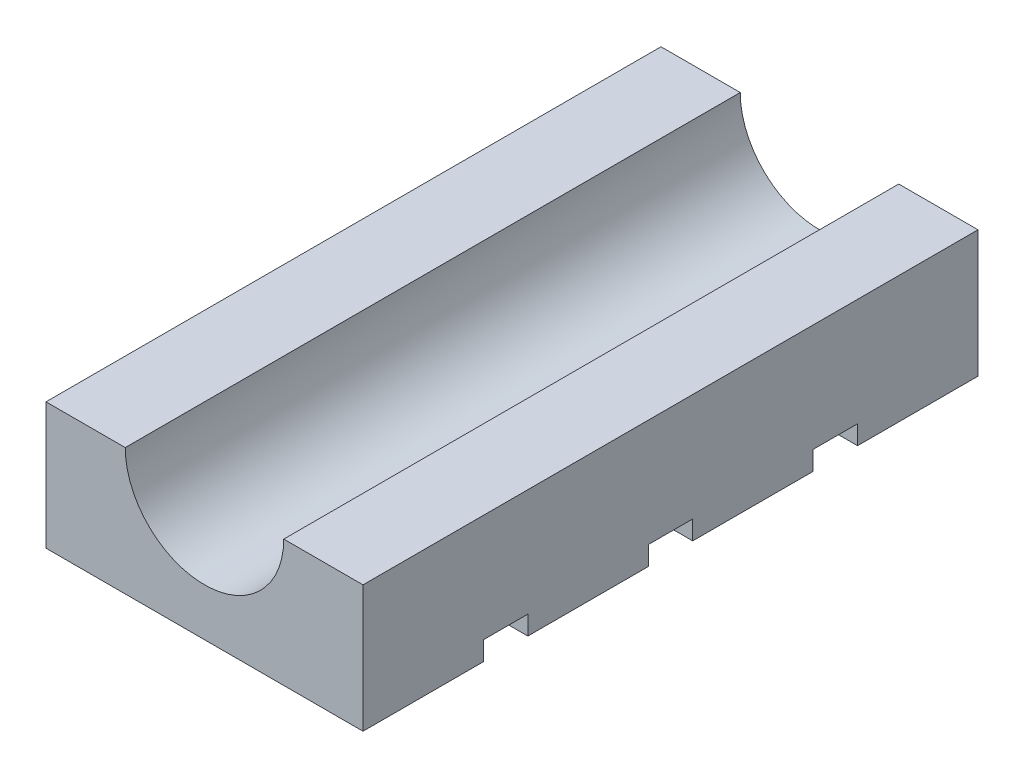
ISO-10303-21;
HEADER;
FILE_DESCRIPTION(('STEP AP214'),'2;1');
FILE_NAME('part.step','',(''),(''),'','','');
FILE_SCHEMA(('AUTOMOTIVE_DESIGN { 1 0 10303 214 1 1 1 1 }'));
ENDSEC;
DATA;
#1=APPLICATION_CONTEXT('core data for automotive mechanical design processes');
#2=APPLICATION_PROTOCOL_DEFINITION('international standard','automotive_design',2000,#1);
#3=PRODUCT_CONTEXT('',#1,'mechanical');
#4=PRODUCT('Part','Part','',(#3));
#5=PRODUCT_RELATED_PRODUCT_CATEGORY('part','',(#4));
#6=PRODUCT_DEFINITION_FORMATION('','',#4);
#7=PRODUCT_DEFINITION_CONTEXT('part definition',#1,'design');
#8=PRODUCT_DEFINITION('design','',#6,#7);
#9=PRODUCT_DEFINITION_SHAPE('','',#8);
#10=(LENGTH_UNIT() NAMED_UNIT(*) SI_UNIT(.MILLI.,.METRE.));
#11=(NAMED_UNIT(*) PLANE_ANGLE_UNIT() SI_UNIT($,.RADIAN.));
#12=(NAMED_UNIT(*) SI_UNIT($,.STERADIAN.) SOLID_ANGLE_UNIT());
#13=UNCERTAINTY_MEASURE_WITH_UNIT(LENGTH_MEASURE(1.E-05),#10,'distance_accuracy_value','');
#14=(GEOMETRIC_REPRESENTATION_CONTEXT(3) GLOBAL_UNCERTAINTY_ASSIGNED_CONTEXT((#13)) GLOBAL_UNIT_ASSIGNED_CONTEXT((#10,
#11,#12)) REPRESENTATION_CONTEXT('',''));
#15=CARTESIAN_POINT('',(0.,0.,0.));
#16=DIRECTION('',(0.,0.,1.));
#17=DIRECTION('',(1.,0.,0.));
#18=AXIS2_PLACEMENT_3D('',#15,#16,#17);
#19=CARTESIAN_POINT('',(0.,0.,0.));
#20=DIRECTION('',(0.,1.,0.));
#21=DIRECTION('',(0.,0.,1.));
#22=AXIS2_PLACEMENT_3D('',#19,#20,#21);
#23=PLANE('',#22);
#24=DIRECTION('',(0.,0.,1.));
#25=VECTOR('',#24,1.);
#26=CARTESIAN_POINT('',(0.,0.,0.));
#27=LINE('',#26,#25);
#28=CARTESIAN_POINT('',(0.,0.,78.));
#29=VERTEX_POINT('',#28);
#30=CARTESIAN_POINT('',(0.,0.,97.));
#31=VERTEX_POINT('',#30);
#32=EDGE_CURVE('E239',#29,#31,#27,.T.);
#33=ORIENTED_EDGE('',*,*,#32,.F.);
#34=DIRECTION('',(-1.,0.,0.));
#35=VECTOR('',#34,1.);
#36=CARTESIAN_POINT('',(0.,0.,78.));
#37=LINE('',#36,#35);
#38=CARTESIAN_POINT('',(50.,0.,78.));
#39=VERTEX_POINT('',#38);
#40=EDGE_CURVE('E172',#39,#29,#37,.T.);
#41=ORIENTED_EDGE('',*,*,#40,.F.);
#42=DIRECTION('',(0.,0.,-1.));
#43=VECTOR('',#42,1.);
#44=CARTESIAN_POINT('',(50.,0.,0.));
#45=LINE('',#44,#43);
#46=CARTESIAN_POINT('',(50.,0.,97.));
#47=VERTEX_POINT('',#46);
#48=EDGE_CURVE('E262',#47,#39,#45,.T.);
#49=ORIENTED_EDGE('',*,*,#48,.F.);
#50=DIRECTION('',(1.,0.,0.));
#51=VECTOR('',#50,1.);
#52=CARTESIAN_POINT('',(0.,0.,97.));
#53=LINE('',#52,#51);
#54=EDGE_CURVE('E258',#31,#47,#53,.T.);
#55=ORIENTED_EDGE('',*,*,#54,.F.);
#56=EDGE_LOOP('',(#33,#41,#49,#55));
#57=FACE_BOUND('',#56,.T.);
#58=ADVANCED_FACE('F33',(#57),#23,.F.);
#59=CARTESIAN_POINT('',(50.,0.,71.));
#60=VERTEX_POINT('',#59);
#61=CARTESIAN_POINT('',(50.,0.,52.));
#62=VERTEX_POINT('',#61);
#63=EDGE_CURVE('E265',#60,#62,#45,.T.);
#64=ORIENTED_EDGE('',*,*,#63,.F.);
#65=DIRECTION('',(1.,0.,0.));
#66=VECTOR('',#65,1.);
#67=CARTESIAN_POINT('',(0.,0.,71.));
#68=LINE('',#67,#66);
#69=CARTESIAN_POINT('',(0.,0.,71.));
#70=VERTEX_POINT('',#69);
#71=EDGE_CURVE('E202',#70,#60,#68,.T.);
#72=ORIENTED_EDGE('',*,*,#71,.F.);
#73=CARTESIAN_POINT('',(0.,0.,52.));
#74=VERTEX_POINT('',#73);
#75=EDGE_CURVE('E177',#74,#70,#27,.T.);
#76=ORIENTED_EDGE('',*,*,#75,.F.);
#77=DIRECTION('',(-1.,0.,0.));
#78=VECTOR('',#77,1.);
#79=CARTESIAN_POINT('',(0.,0.,52.));
#80=LINE('',#79,#78);
#81=EDGE_CURVE('E188',#62,#74,#80,.T.);
#82=ORIENTED_EDGE('',*,*,#81,.F.);
#83=EDGE_LOOP('',(#64,#72,#76,#82));
#84=FACE_BOUND('',#83,.T.);
#85=ADVANCED_FACE('F326',(#84),#23,.F.);
#86=CARTESIAN_POINT('',(50.,0.,45.));
#87=VERTEX_POINT('',#86);
#88=CARTESIAN_POINT('',(50.,0.,26.));
#89=VERTEX_POINT('',#88);
#90=EDGE_CURVE('E327',#87,#89,#45,.T.);
#91=ORIENTED_EDGE('',*,*,#90,.F.);
#92=DIRECTION('',(1.,0.,0.));
#93=VECTOR('',#92,1.);
#94=CARTESIAN_POINT('',(0.,0.,45.));
#95=LINE('',#94,#93);
#96=CARTESIAN_POINT('',(0.,0.,45.));
#97=VERTEX_POINT('',#96);
#98=EDGE_CURVE('E196',#97,#87,#95,.T.);
#99=ORIENTED_EDGE('',*,*,#98,.F.);
#100=CARTESIAN_POINT('',(0.,0.,26.));
#101=VERTEX_POINT('',#100);
#102=EDGE_CURVE('E259',#101,#97,#27,.T.);
#103=ORIENTED_EDGE('',*,*,#102,.F.);
#104=DIRECTION('',(-1.,0.,0.));
#105=VECTOR('',#104,1.);
#106=CARTESIAN_POINT('',(0.,0.,26.));
#107=LINE('',#106,#105);
#108=EDGE_CURVE('E213',#89,#101,#107,.T.);
#109=ORIENTED_EDGE('',*,*,#108,.F.);
#110=EDGE_LOOP('',(#91,#99,#103,#109));
#111=FACE_BOUND('',#110,.T.);
#112=ADVANCED_FACE('F335',(#111),#23,.F.);
#113=CARTESIAN_POINT('',(0.,20.,0.));
#114=DIRECTION('',(0.,1.,0.));
#115=DIRECTION('',(0.,0.,1.));
#116=AXIS2_PLACEMENT_3D('',#113,#114,#115);
#117=PLANE('',#116);
#118=DIRECTION('',(0.,0.,1.));
#119=VECTOR('',#118,1.);
#120=CARTESIAN_POINT('',(12.5,20.,-3.));
#121=LINE('',#120,#119);
#122=CARTESIAN_POINT('',(12.5,20.,0.));
#123=VERTEX_POINT('',#122);
#124=CARTESIAN_POINT('',(12.5,20.,97.));
#125=VERTEX_POINT('',#124);
#126=EDGE_CURVE('E11',#123,#125,#121,.T.);
#127=ORIENTED_EDGE('',*,*,#126,.F.);
#128=DIRECTION('',(-1.,0.,0.));
#129=VECTOR('',#128,1.);
#130=CARTESIAN_POINT('',(0.,20.,0.));
#131=LINE('',#130,#129);
#132=CARTESIAN_POINT('',(0.,20.,0.));
#133=VERTEX_POINT('',#132);
#134=EDGE_CURVE('E250',#123,#133,#131,.T.);
#135=ORIENTED_EDGE('',*,*,#134,.T.);
#136=DIRECTION('',(0.,0.,1.));
#137=VECTOR('',#136,1.);
#138=CARTESIAN_POINT('',(0.,20.,0.));
#139=LINE('',#138,#137);
#140=CARTESIAN_POINT('',(0.,20.,97.));
#141=VERTEX_POINT('',#140);
#142=EDGE_CURVE('E240',#133,#141,#139,.T.);
#143=ORIENTED_EDGE('',*,*,#142,.T.);
#144=DIRECTION('',(1.,0.,0.));
#145=VECTOR('',#144,1.);
#146=CARTESIAN_POINT('',(0.,20.,97.));
#147=LINE('',#146,#145);
#148=EDGE_CURVE('E245',#141,#125,#147,.T.);
#149=ORIENTED_EDGE('',*,*,#148,.T.);
#150=EDGE_LOOP('',(#127,#135,#143,#149));
#151=FACE_BOUND('',#150,.T.);
#152=ADVANCED_FACE('F306',(#151),#117,.T.);
#153=CARTESIAN_POINT('',(0.,20.,0.));
#154=DIRECTION('',(1.,0.,0.));
#155=DIRECTION('',(0.,0.,-1.));
#156=AXIS2_PLACEMENT_3D('',#153,#154,#155);
#157=PLANE('',#156);
#158=DIRECTION('',(0.,0.,-1.));
#159=VECTOR('',#158,1.);
#160=CARTESIAN_POINT('',(0.,3.,78.));
#161=LINE('',#160,#159);
#162=CARTESIAN_POINT('',(0.,3.,78.));
#163=VERTEX_POINT('',#162);
#164=CARTESIAN_POINT('',(0.,3.,71.));
#165=VERTEX_POINT('',#164);
#166=EDGE_CURVE('E163',#163,#165,#161,.T.);
#167=ORIENTED_EDGE('',*,*,#166,.F.);
#168=DIRECTION('',(0.,-1.,0.));
#169=VECTOR('',#168,1.);
#170=CARTESIAN_POINT('',(0.,3.,78.));
#171=LINE('',#170,#169);
#172=EDGE_CURVE('E236',#163,#29,#171,.T.);
#173=ORIENTED_EDGE('',*,*,#172,.T.);
#174=ORIENTED_EDGE('',*,*,#32,.T.);
#175=DIRECTION('',(0.,-1.,0.));
#176=VECTOR('',#175,1.);
#177=CARTESIAN_POINT('',(0.,20.,97.));
#178=LINE('',#177,#176);
#179=EDGE_CURVE('E275',#141,#31,#178,.T.);
#180=ORIENTED_EDGE('',*,*,#179,.F.);
#181=ORIENTED_EDGE('',*,*,#142,.F.);
#182=DIRECTION('',(0.,-1.,0.));
#183=VECTOR('',#182,1.);
#184=CARTESIAN_POINT('',(0.,20.,0.));
#185=LINE('',#184,#183);
#186=CARTESIAN_POINT('',(0.,0.,0.));
#187=VERTEX_POINT('',#186);
#188=EDGE_CURVE('E254',#133,#187,#185,.T.);
#189=ORIENTED_EDGE('',*,*,#188,.T.);
#190=CARTESIAN_POINT('',(0.,0.,19.));
#191=VERTEX_POINT('',#190);
#192=EDGE_CURVE('E255',#187,#191,#27,.T.);
#193=ORIENTED_EDGE('',*,*,#192,.T.);
#194=DIRECTION('',(0.,-1.,0.));
#195=VECTOR('',#194,1.);
#196=CARTESIAN_POINT('',(0.,3.,19.));
#197=LINE('',#196,#195);
#198=CARTESIAN_POINT('',(0.,3.,19.));
#199=VERTEX_POINT('',#198);
#200=EDGE_CURVE('E221',#199,#191,#197,.T.);
#201=ORIENTED_EDGE('',*,*,#200,.F.);
#202=DIRECTION('',(0.,0.,-1.));
#203=VECTOR('',#202,1.);
#204=CARTESIAN_POINT('',(0.,3.,26.));
#205=LINE('',#204,#203);
#206=CARTESIAN_POINT('',(0.,3.,26.));
#207=VERTEX_POINT('',#206);
#208=EDGE_CURVE('E209',#207,#199,#205,.T.);
#209=ORIENTED_EDGE('',*,*,#208,.F.);
#210=DIRECTION('',(0.,-1.,0.));
#211=VECTOR('',#210,1.);
#212=CARTESIAN_POINT('',(0.,3.,26.));
#213=LINE('',#212,#211);
#214=EDGE_CURVE('E198',#207,#101,#213,.T.);
#215=ORIENTED_EDGE('',*,*,#214,.T.);
#216=ORIENTED_EDGE('',*,*,#102,.T.);
#217=DIRECTION('',(0.,-1.,0.));
#218=VECTOR('',#217,1.);
#219=CARTESIAN_POINT('',(0.,3.,45.));
#220=LINE('',#219,#218);
#221=CARTESIAN_POINT('',(0.,3.,45.));
#222=VERTEX_POINT('',#221);
#223=EDGE_CURVE('E56',#222,#97,#220,.T.);
#224=ORIENTED_EDGE('',*,*,#223,.F.);
#225=DIRECTION('',(0.,0.,-1.));
#226=VECTOR('',#225,1.);
#227=CARTESIAN_POINT('',(0.,3.,52.));
#228=LINE('',#227,#226);
#229=CARTESIAN_POINT('',(0.,3.,52.));
#230=VERTEX_POINT('',#229);
#231=EDGE_CURVE('E184',#230,#222,#228,.T.);
#232=ORIENTED_EDGE('',*,*,#231,.F.);
#233=DIRECTION('',(0.,-1.,0.));
#234=VECTOR('',#233,1.);
#235=CARTESIAN_POINT('',(0.,3.,52.));
#236=LINE('',#235,#234);
#237=EDGE_CURVE('E200',#230,#74,#236,.T.);
#238=ORIENTED_EDGE('',*,*,#237,.T.);
#239=ORIENTED_EDGE('',*,*,#75,.T.);
#240=DIRECTION('',(0.,-1.,0.));
#241=VECTOR('',#240,1.);
#242=CARTESIAN_POINT('',(0.,3.,71.));
#243=LINE('',#242,#241);
#244=EDGE_CURVE('E48',#165,#70,#243,.T.);
#245=ORIENTED_EDGE('',*,*,#244,.F.);
#246=EDGE_LOOP('',(#167,#173,#174,#180,#181,#189,#193,#201,#209,#215,#216,#224,#232,#238,#239,#245));
#247=FACE_BOUND('',#246,.T.);
#248=ADVANCED_FACE('F35',(#247),#157,.F.);
#249=CARTESIAN_POINT('',(0.,20.,97.));
#250=DIRECTION('',(0.,0.,-1.));
#251=DIRECTION('',(-1.,0.,0.));
#252=AXIS2_PLACEMENT_3D('',#249,#250,#251);
#253=PLANE('',#252);
#254=CARTESIAN_POINT('',(37.5,20.,97.));
#255=VERTEX_POINT('',#254);
#256=CARTESIAN_POINT('',(50.,20.,97.));
#257=VERTEX_POINT('',#256);
#258=EDGE_CURVE('E243',#255,#257,#147,.T.);
#259=ORIENTED_EDGE('',*,*,#258,.F.);
#260=CARTESIAN_POINT('',(25.,20.,97.));
#261=DIRECTION('',(0.,0.,1.));
#262=DIRECTION('',(1.,0.,0.));
#263=AXIS2_PLACEMENT_3D('',#260,#261,#262);
#264=CIRCLE('',#263,12.5);
#265=EDGE_CURVE('E233',#125,#255,#264,.T.);
#266=ORIENTED_EDGE('',*,*,#265,.F.);
#267=ORIENTED_EDGE('',*,*,#148,.F.);
#268=ORIENTED_EDGE('',*,*,#179,.T.);
#269=ORIENTED_EDGE('',*,*,#54,.T.);
#270=DIRECTION('',(0.,-1.,0.));
#271=VECTOR('',#270,1.);
#272=CARTESIAN_POINT('',(50.,20.,97.));
#273=LINE('',#272,#271);
#274=EDGE_CURVE('E272',#257,#47,#273,.T.);
#275=ORIENTED_EDGE('',*,*,#274,.F.);
#276=EDGE_LOOP('',(#259,#266,#267,#268,#269,#275));
#277=FACE_BOUND('',#276,.T.);
#278=ADVANCED_FACE('F308',(#277),#253,.F.);
#279=CARTESIAN_POINT('',(50.,20.,0.));
#280=DIRECTION('',(-1.,0.,0.));
#281=DIRECTION('',(0.,0.,1.));
#282=AXIS2_PLACEMENT_3D('',#279,#280,#281);
#283=PLANE('',#282);
#284=ORIENTED_EDGE('',*,*,#48,.T.);
#285=DIRECTION('',(0.,-1.,0.));
#286=VECTOR('',#285,1.);
#287=CARTESIAN_POINT('',(50.,3.,78.));
#288=LINE('',#287,#286);
#289=CARTESIAN_POINT('',(50.,3.,78.));
#290=VERTEX_POINT('',#289);
#291=EDGE_CURVE('E179',#290,#39,#288,.T.);
#292=ORIENTED_EDGE('',*,*,#291,.F.);
#293=DIRECTION('',(0.,0.,1.));
#294=VECTOR('',#293,1.);
#295=CARTESIAN_POINT('',(50.,3.,78.));
#296=LINE('',#295,#294);
#297=CARTESIAN_POINT('',(50.,3.,71.));
#298=VERTEX_POINT('',#297);
#299=EDGE_CURVE('E162',#298,#290,#296,.T.);
#300=ORIENTED_EDGE('',*,*,#299,.F.);
#301=DIRECTION('',(0.,-1.,0.));
#302=VECTOR('',#301,1.);
#303=CARTESIAN_POINT('',(50.,3.,71.));
#304=LINE('',#303,#302);
#305=EDGE_CURVE('E159',#298,#60,#304,.T.);
#306=ORIENTED_EDGE('',*,*,#305,.T.);
#307=ORIENTED_EDGE('',*,*,#63,.T.);
#308=DIRECTION('',(0.,-1.,0.));
#309=VECTOR('',#308,1.);
#310=CARTESIAN_POINT('',(50.,3.,52.));
#311=LINE('',#310,#309);
#312=CARTESIAN_POINT('',(50.,3.,52.));
#313=VERTEX_POINT('',#312);
#314=EDGE_CURVE('E203',#313,#62,#311,.T.);
#315=ORIENTED_EDGE('',*,*,#314,.F.);
#316=DIRECTION('',(0.,0.,1.));
#317=VECTOR('',#316,1.);
#318=CARTESIAN_POINT('',(50.,3.,52.));
#319=LINE('',#318,#317);
#320=CARTESIAN_POINT('',(50.,3.,45.));
#321=VERTEX_POINT('',#320);
#322=EDGE_CURVE('E191',#321,#313,#319,.T.);
#323=ORIENTED_EDGE('',*,*,#322,.F.);
#324=DIRECTION('',(0.,-1.,0.));
#325=VECTOR('',#324,1.);
#326=CARTESIAN_POINT('',(50.,3.,45.));
#327=LINE('',#326,#325);
#328=EDGE_CURVE('E205',#321,#87,#327,.T.);
#329=ORIENTED_EDGE('',*,*,#328,.T.);
#330=ORIENTED_EDGE('',*,*,#90,.T.);
#331=DIRECTION('',(0.,-1.,0.));
#332=VECTOR('',#331,1.);
#333=CARTESIAN_POINT('',(50.,3.,26.));
#334=LINE('',#333,#332);
#335=CARTESIAN_POINT('',(50.,3.,26.));
#336=VERTEX_POINT('',#335);
#337=EDGE_CURVE('E227',#336,#89,#334,.T.);
#338=ORIENTED_EDGE('',*,*,#337,.F.);
#339=DIRECTION('',(0.,0.,1.));
#340=VECTOR('',#339,1.);
#341=CARTESIAN_POINT('',(50.,3.,26.));
#342=LINE('',#341,#340);
#343=CARTESIAN_POINT('',(50.,3.,19.));
#344=VERTEX_POINT('',#343);
#345=EDGE_CURVE('E216',#344,#336,#342,.T.);
#346=ORIENTED_EDGE('',*,*,#345,.F.);
#347=DIRECTION('',(0.,-1.,0.));
#348=VECTOR('',#347,1.);
#349=CARTESIAN_POINT('',(50.,3.,19.));
#350=LINE('',#349,#348);
#351=CARTESIAN_POINT('',(50.,0.,19.));
#352=VERTEX_POINT('',#351);
#353=EDGE_CURVE('E229',#344,#352,#350,.T.);
#354=ORIENTED_EDGE('',*,*,#353,.T.);
#355=CARTESIAN_POINT('',(50.,0.,0.));
#356=VERTEX_POINT('',#355);
#357=EDGE_CURVE('E261',#352,#356,#45,.T.);
#358=ORIENTED_EDGE('',*,*,#357,.T.);
#359=DIRECTION('',(0.,-1.,0.));
#360=VECTOR('',#359,1.);
#361=CARTESIAN_POINT('',(50.,20.,0.));
#362=LINE('',#361,#360);
#363=CARTESIAN_POINT('',(50.,20.,0.));
#364=VERTEX_POINT('',#363);
#365=EDGE_CURVE('E269',#364,#356,#362,.T.);
#366=ORIENTED_EDGE('',*,*,#365,.F.);
#367=DIRECTION('',(0.,0.,-1.));
#368=VECTOR('',#367,1.);
#369=CARTESIAN_POINT('',(50.,20.,0.));
#370=LINE('',#369,#368);
#371=EDGE_CURVE('E248',#257,#364,#370,.T.);
#372=ORIENTED_EDGE('',*,*,#371,.F.);
#373=ORIENTED_EDGE('',*,*,#274,.T.);
#374=EDGE_LOOP('',(#284,#292,#300,#306,#307,#315,#323,#329,#330,#338,#346,#354,#358,#366,#372,#373));
#375=FACE_BOUND('',#374,.T.);
#376=ADVANCED_FACE('F294',(#375),#283,.F.);
#377=CARTESIAN_POINT('',(0.,20.,0.));
#378=DIRECTION('',(0.,0.,1.));
#379=DIRECTION('',(1.,0.,0.));
#380=AXIS2_PLACEMENT_3D('',#377,#378,#379);
#381=PLANE('',#380);
#382=ORIENTED_EDGE('',*,*,#134,.F.);
#383=CARTESIAN_POINT('',(25.,20.,0.));
#384=DIRECTION('',(0.,0.,1.));
#385=DIRECTION('',(1.,0.,0.));
#386=AXIS2_PLACEMENT_3D('',#383,#384,#385);
#387=CIRCLE('',#386,12.5);
#388=CARTESIAN_POINT('',(37.5,20.,0.));
#389=VERTEX_POINT('',#388);
#390=EDGE_CURVE('E235',#123,#389,#387,.T.);
#391=ORIENTED_EDGE('',*,*,#390,.T.);
#392=EDGE_CURVE('E251',#364,#389,#131,.T.);
#393=ORIENTED_EDGE('',*,*,#392,.F.);
#394=ORIENTED_EDGE('',*,*,#365,.T.);
#395=DIRECTION('',(-1.,0.,0.));
#396=VECTOR('',#395,1.);
#397=CARTESIAN_POINT('',(0.,0.,0.));
#398=LINE('',#397,#396);
#399=EDGE_CURVE('E244',#356,#187,#398,.T.);
#400=ORIENTED_EDGE('',*,*,#399,.T.);
#401=ORIENTED_EDGE('',*,*,#188,.F.);
#402=EDGE_LOOP('',(#382,#391,#393,#394,#400,#401));
#403=FACE_BOUND('',#402,.T.);
#404=ADVANCED_FACE('F287',(#403),#381,.F.);
#405=DIRECTION('',(0.,0.,1.));
#406=VECTOR('',#405,1.);
#407=CARTESIAN_POINT('',(37.5,20.,-3.));
#408=LINE('',#407,#406);
#409=EDGE_CURVE('E41',#255,#389,#408,.F.);
#410=ORIENTED_EDGE('',*,*,#409,.F.);
#411=ORIENTED_EDGE('',*,*,#258,.T.);
#412=ORIENTED_EDGE('',*,*,#371,.T.);
#413=ORIENTED_EDGE('',*,*,#392,.T.);
#414=EDGE_LOOP('',(#410,#411,#412,#413));
#415=FACE_BOUND('',#414,.T.);
#416=ADVANCED_FACE('F289',(#415),#117,.T.);
#417=ORIENTED_EDGE('',*,*,#357,.F.);
#418=DIRECTION('',(1.,0.,0.));
#419=VECTOR('',#418,1.);
#420=CARTESIAN_POINT('',(0.,0.,19.));
#421=LINE('',#420,#419);
#422=EDGE_CURVE('E222',#191,#352,#421,.T.);
#423=ORIENTED_EDGE('',*,*,#422,.F.);
#424=ORIENTED_EDGE('',*,*,#192,.F.);
#425=ORIENTED_EDGE('',*,*,#399,.F.);
#426=EDGE_LOOP('',(#417,#423,#424,#425));
#427=FACE_BOUND('',#426,.T.);
#428=ADVANCED_FACE('F299',(#427),#23,.F.);
#429=CARTESIAN_POINT('',(25.,20.,-3.));
#430=DIRECTION('',(0.,0.,1.));
#431=DIRECTION('',(1.,0.,0.));
#432=AXIS2_PLACEMENT_3D('',#429,#430,#431);
#433=CYLINDRICAL_SURFACE('',#432,12.5);
#434=ORIENTED_EDGE('',*,*,#126,.T.);
#435=ORIENTED_EDGE('',*,*,#265,.T.);
#436=ORIENTED_EDGE('',*,*,#409,.T.);
#437=ORIENTED_EDGE('',*,*,#390,.F.);
#438=EDGE_LOOP('',(#434,#435,#436,#437));
#439=FACE_BOUND('',#438,.T.);
#440=ADVANCED_FACE('F279',(#439),#433,.F.);
#441=CARTESIAN_POINT('',(0.,3.,26.));
#442=DIRECTION('',(0.,0.,1.));
#443=DIRECTION('',(1.,0.,0.));
#444=AXIS2_PLACEMENT_3D('',#441,#442,#443);
#445=PLANE('',#444);
#446=ORIENTED_EDGE('',*,*,#108,.T.);
#447=ORIENTED_EDGE('',*,*,#214,.F.);
#448=DIRECTION('',(-1.,0.,0.));
#449=VECTOR('',#448,1.);
#450=CARTESIAN_POINT('',(0.,3.,26.));
#451=LINE('',#450,#449);
#452=EDGE_CURVE('E218',#336,#207,#451,.T.);
#453=ORIENTED_EDGE('',*,*,#452,.F.);
#454=ORIENTED_EDGE('',*,*,#337,.T.);
#455=EDGE_LOOP('',(#446,#447,#453,#454));
#456=FACE_BOUND('',#455,.T.);
#457=ADVANCED_FACE('F339',(#456),#445,.F.);
#458=CARTESIAN_POINT('',(0.,3.,19.));
#459=DIRECTION('',(0.,0.,-1.));
#460=DIRECTION('',(-1.,0.,0.));
#461=AXIS2_PLACEMENT_3D('',#458,#459,#460);
#462=PLANE('',#461);
#463=ORIENTED_EDGE('',*,*,#422,.T.);
#464=ORIENTED_EDGE('',*,*,#353,.F.);
#465=DIRECTION('',(1.,0.,0.));
#466=VECTOR('',#465,1.);
#467=CARTESIAN_POINT('',(0.,3.,19.));
#468=LINE('',#467,#466);
#469=EDGE_CURVE('E212',#199,#344,#468,.T.);
#470=ORIENTED_EDGE('',*,*,#469,.F.);
#471=ORIENTED_EDGE('',*,*,#200,.T.);
#472=EDGE_LOOP('',(#463,#464,#470,#471));
#473=FACE_BOUND('',#472,.T.);
#474=ADVANCED_FACE('F344',(#473),#462,.F.);
#475=CARTESIAN_POINT('',(0.,3.,0.));
#476=DIRECTION('',(0.,-1.,0.));
#477=DIRECTION('',(0.,0.,-1.));
#478=AXIS2_PLACEMENT_3D('',#475,#476,#477);
#479=PLANE('',#478);
#480=ORIENTED_EDGE('',*,*,#208,.T.);
#481=ORIENTED_EDGE('',*,*,#469,.T.);
#482=ORIENTED_EDGE('',*,*,#345,.T.);
#483=ORIENTED_EDGE('',*,*,#452,.T.);
#484=EDGE_LOOP('',(#480,#481,#482,#483));
#485=FACE_BOUND('',#484,.T.);
#486=ADVANCED_FACE('F342',(#485),#479,.T.);
#487=CARTESIAN_POINT('',(0.,3.,52.));
#488=DIRECTION('',(0.,0.,1.));
#489=DIRECTION('',(1.,0.,0.));
#490=AXIS2_PLACEMENT_3D('',#487,#488,#489);
#491=PLANE('',#490);
#492=ORIENTED_EDGE('',*,*,#81,.T.);
#493=ORIENTED_EDGE('',*,*,#237,.F.);
#494=DIRECTION('',(-1.,0.,0.));
#495=VECTOR('',#494,1.);
#496=CARTESIAN_POINT('',(0.,3.,52.));
#497=LINE('',#496,#495);
#498=EDGE_CURVE('E193',#313,#230,#497,.T.);
#499=ORIENTED_EDGE('',*,*,#498,.F.);
#500=ORIENTED_EDGE('',*,*,#314,.T.);
#501=EDGE_LOOP('',(#492,#493,#499,#500));
#502=FACE_BOUND('',#501,.T.);
#503=ADVANCED_FACE('F351',(#502),#491,.F.);
#504=CARTESIAN_POINT('',(0.,3.,45.));
#505=DIRECTION('',(0.,0.,-1.));
#506=DIRECTION('',(-1.,0.,0.));
#507=AXIS2_PLACEMENT_3D('',#504,#505,#506);
#508=PLANE('',#507);
#509=ORIENTED_EDGE('',*,*,#98,.T.);
#510=ORIENTED_EDGE('',*,*,#328,.F.);
#511=DIRECTION('',(1.,0.,0.));
#512=VECTOR('',#511,1.);
#513=CARTESIAN_POINT('',(0.,3.,45.));
#514=LINE('',#513,#512);
#515=EDGE_CURVE('E187',#222,#321,#514,.T.);
#516=ORIENTED_EDGE('',*,*,#515,.F.);
#517=ORIENTED_EDGE('',*,*,#223,.T.);
#518=EDGE_LOOP('',(#509,#510,#516,#517));
#519=FACE_BOUND('',#518,.T.);
#520=ADVANCED_FACE('F449',(#519),#508,.F.);
#521=CARTESIAN_POINT('',(0.,3.,0.));
#522=DIRECTION('',(0.,-1.,0.));
#523=DIRECTION('',(0.,0.,-1.));
#524=AXIS2_PLACEMENT_3D('',#521,#522,#523);
#525=PLANE('',#524);
#526=ORIENTED_EDGE('',*,*,#231,.T.);
#527=ORIENTED_EDGE('',*,*,#515,.T.);
#528=ORIENTED_EDGE('',*,*,#322,.T.);
#529=ORIENTED_EDGE('',*,*,#498,.T.);
#530=EDGE_LOOP('',(#526,#527,#528,#529));
#531=FACE_BOUND('',#530,.T.);
#532=ADVANCED_FACE('F459',(#531),#525,.T.);
#533=CARTESIAN_POINT('',(0.,3.,78.));
#534=DIRECTION('',(0.,0.,1.));
#535=DIRECTION('',(1.,0.,0.));
#536=AXIS2_PLACEMENT_3D('',#533,#534,#535);
#537=PLANE('',#536);
#538=ORIENTED_EDGE('',*,*,#40,.T.);
#539=ORIENTED_EDGE('',*,*,#172,.F.);
#540=DIRECTION('',(-1.,0.,0.));
#541=VECTOR('',#540,1.);
#542=CARTESIAN_POINT('',(0.,3.,78.));
#543=LINE('',#542,#541);
#544=EDGE_CURVE('E169',#290,#163,#543,.T.);
#545=ORIENTED_EDGE('',*,*,#544,.F.);
#546=ORIENTED_EDGE('',*,*,#291,.T.);
#547=EDGE_LOOP('',(#538,#539,#545,#546));
#548=FACE_BOUND('',#547,.T.);
#549=ADVANCED_FACE('F319',(#548),#537,.F.);
#550=CARTESIAN_POINT('',(0.,3.,71.));
#551=DIRECTION('',(0.,0.,-1.));
#552=DIRECTION('',(-1.,0.,0.));
#553=AXIS2_PLACEMENT_3D('',#550,#551,#552);
#554=PLANE('',#553);
#555=ORIENTED_EDGE('',*,*,#71,.T.);
#556=ORIENTED_EDGE('',*,*,#305,.F.);
#557=DIRECTION('',(1.,0.,0.));
#558=VECTOR('',#557,1.);
#559=CARTESIAN_POINT('',(0.,3.,71.));
#560=LINE('',#559,#558);
#561=EDGE_CURVE('E155',#165,#298,#560,.T.);
#562=ORIENTED_EDGE('',*,*,#561,.F.);
#563=ORIENTED_EDGE('',*,*,#244,.T.);
#564=EDGE_LOOP('',(#555,#556,#562,#563));
#565=FACE_BOUND('',#564,.T.);
#566=ADVANCED_FACE('F157',(#565),#554,.F.);
#567=CARTESIAN_POINT('',(0.,3.,0.));
#568=DIRECTION('',(0.,-1.,0.));
#569=DIRECTION('',(0.,0.,-1.));
#570=AXIS2_PLACEMENT_3D('',#567,#568,#569);
#571=PLANE('',#570);
#572=ORIENTED_EDGE('',*,*,#166,.T.);
#573=ORIENTED_EDGE('',*,*,#561,.T.);
#574=ORIENTED_EDGE('',*,*,#299,.T.);
#575=ORIENTED_EDGE('',*,*,#544,.T.);
#576=EDGE_LOOP('',(#572,#573,#574,#575));
#577=FACE_BOUND('',#576,.T.);
#578=ADVANCED_FACE('F167',(#577),#571,.T.);
#579=CLOSED_SHELL('',(#58,#85,#112,#152,#248,#278,#376,#404,#416,#428,#440,#457,#474,#486,#503,
#520,#532,#549,#566,#578));
#580=MANIFOLD_SOLID_BREP('B2',#579);
#581=ADVANCED_BREP_SHAPE_REPRESENTATION('',(#18,#580),#14);
#582=SHAPE_DEFINITION_REPRESENTATION(#9,#581);
ENDSEC;
END-ISO-10303-21;
